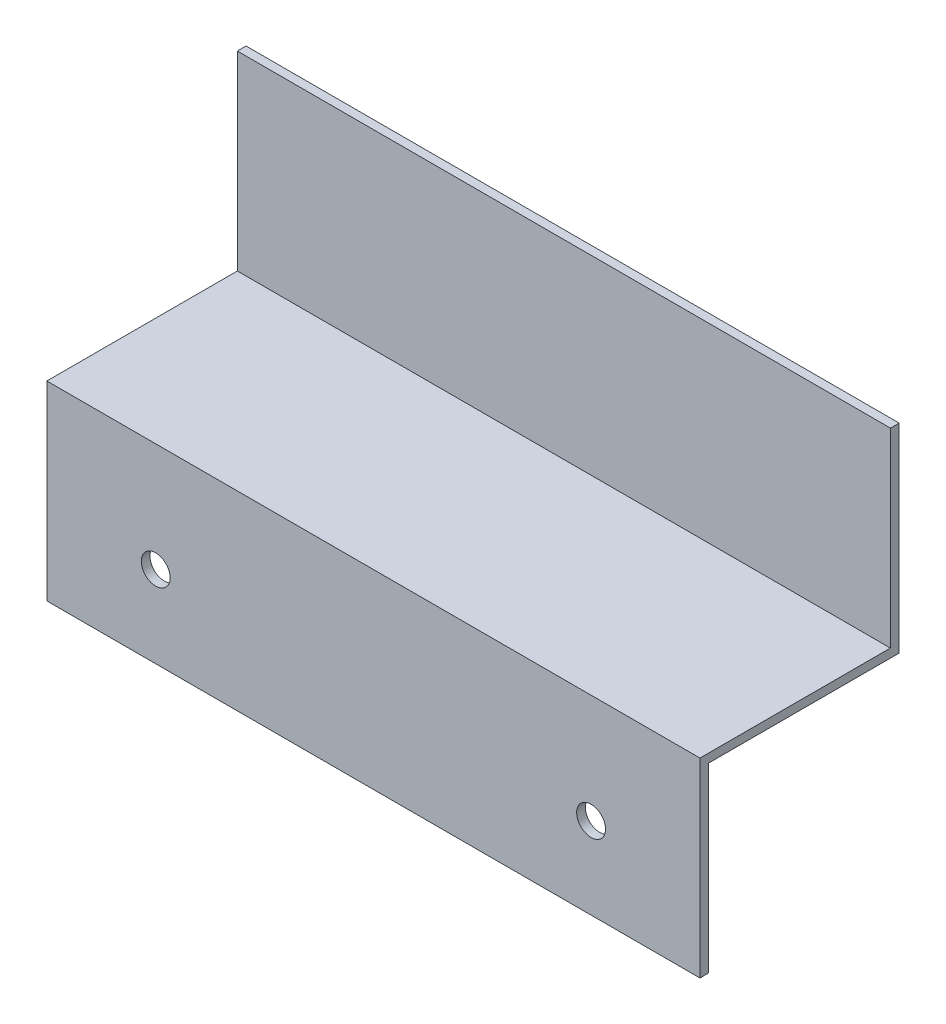
ISO-10303-21;
HEADER;
FILE_DESCRIPTION(('STEP AP214'),'2;1');
FILE_NAME('part.step','',(''),(''),'','','');
FILE_SCHEMA(('AUTOMOTIVE_DESIGN { 1 0 10303 214 1 1 1 1 }'));
ENDSEC;
DATA;
#1=APPLICATION_CONTEXT('core data for automotive mechanical design processes');
#2=APPLICATION_PROTOCOL_DEFINITION('international standard','automotive_design',2000,#1);
#3=PRODUCT_CONTEXT('',#1,'mechanical');
#4=PRODUCT('Part','Part','',(#3));
#5=PRODUCT_RELATED_PRODUCT_CATEGORY('part','',(#4));
#6=PRODUCT_DEFINITION_FORMATION('','',#4);
#7=PRODUCT_DEFINITION_CONTEXT('part definition',#1,'design');
#8=PRODUCT_DEFINITION('design','',#6,#7);
#9=PRODUCT_DEFINITION_SHAPE('','',#8);
#10=(LENGTH_UNIT() NAMED_UNIT(*) SI_UNIT(.MILLI.,.METRE.));
#11=(NAMED_UNIT(*) PLANE_ANGLE_UNIT() SI_UNIT($,.RADIAN.));
#12=(NAMED_UNIT(*) SI_UNIT($,.STERADIAN.) SOLID_ANGLE_UNIT());
#13=UNCERTAINTY_MEASURE_WITH_UNIT(LENGTH_MEASURE(1.E-05),#10,'distance_accuracy_value','');
#14=(GEOMETRIC_REPRESENTATION_CONTEXT(3) GLOBAL_UNCERTAINTY_ASSIGNED_CONTEXT((#13)) GLOBAL_UNIT_ASSIGNED_CONTEXT((#10,
#11,#12)) REPRESENTATION_CONTEXT('',''));
#15=CARTESIAN_POINT('',(0.,0.,0.));
#16=DIRECTION('',(0.,0.,1.));
#17=DIRECTION('',(1.,0.,0.));
#18=AXIS2_PLACEMENT_3D('',#15,#16,#17);
#19=CARTESIAN_POINT('',(152.4,0.,0.));
#20=DIRECTION('',(0.,-1.,0.));
#21=DIRECTION('',(0.,0.,-1.));
#22=AXIS2_PLACEMENT_3D('',#19,#20,#21);
#23=PLANE('',#22);
#24=DIRECTION('',(0.,0.,1.));
#25=VECTOR('',#24,1.);
#26=CARTESIAN_POINT('',(0.,0.,0.));
#27=LINE('',#26,#25);
#28=CARTESIAN_POINT('',(0.,0.,-2.032));
#29=VERTEX_POINT('',#28);
#30=CARTESIAN_POINT('',(0.,0.,0.));
#31=VERTEX_POINT('',#30);
#32=EDGE_CURVE('E131',#29,#31,#27,.T.);
#33=ORIENTED_EDGE('',*,*,#32,.T.);
#34=DIRECTION('',(-1.,0.,0.));
#35=VECTOR('',#34,1.);
#36=CARTESIAN_POINT('',(152.4,0.,0.));
#37=LINE('',#36,#35);
#38=CARTESIAN_POINT('',(152.4,0.,0.));
#39=VERTEX_POINT('',#38);
#40=EDGE_CURVE('E11',#39,#31,#37,.T.);
#41=ORIENTED_EDGE('',*,*,#40,.F.);
#42=DIRECTION('',(0.,0.,1.));
#43=VECTOR('',#42,1.);
#44=CARTESIAN_POINT('',(152.4,0.,0.));
#45=LINE('',#44,#43);
#46=CARTESIAN_POINT('',(152.4,0.,-2.032));
#47=VERTEX_POINT('',#46);
#48=EDGE_CURVE('E145',#47,#39,#45,.T.);
#49=ORIENTED_EDGE('',*,*,#48,.F.);
#50=DIRECTION('',(-1.,0.,0.));
#51=VECTOR('',#50,1.);
#52=CARTESIAN_POINT('',(152.4,0.,-2.032));
#53=LINE('',#52,#51);
#54=EDGE_CURVE('E127',#47,#29,#53,.T.);
#55=ORIENTED_EDGE('',*,*,#54,.T.);
#56=EDGE_LOOP('',(#33,#41,#49,#55));
#57=FACE_BOUND('',#56,.T.);
#58=ADVANCED_FACE('F33',(#57),#23,.F.);
#59=CARTESIAN_POINT('',(152.4,0.,0.));
#60=DIRECTION('',(0.,0.,-1.));
#61=DIRECTION('',(0.,1.,0.));
#62=AXIS2_PLACEMENT_3D('',#59,#60,#61);
#63=PLANE('',#62);
#64=DIRECTION('',(0.,-1.,0.));
#65=VECTOR('',#64,1.);
#66=CARTESIAN_POINT('',(0.,0.,0.));
#67=LINE('',#66,#65);
#68=CARTESIAN_POINT('',(0.,-44.45,0.));
#69=VERTEX_POINT('',#68);
#70=EDGE_CURVE('E134',#31,#69,#67,.T.);
#71=ORIENTED_EDGE('',*,*,#70,.T.);
#72=DIRECTION('',(-1.,0.,0.));
#73=VECTOR('',#72,1.);
#74=CARTESIAN_POINT('',(152.4,-44.45,0.));
#75=LINE('',#74,#73);
#76=CARTESIAN_POINT('',(152.4,-44.45,0.));
#77=VERTEX_POINT('',#76);
#78=EDGE_CURVE('E42',#77,#69,#75,.T.);
#79=ORIENTED_EDGE('',*,*,#78,.F.);
#80=DIRECTION('',(0.,-1.,0.));
#81=VECTOR('',#80,1.);
#82=CARTESIAN_POINT('',(152.4,0.,0.));
#83=LINE('',#82,#81);
#84=EDGE_CURVE('E94',#39,#77,#83,.T.);
#85=ORIENTED_EDGE('',*,*,#84,.F.);
#86=ORIENTED_EDGE('',*,*,#40,.T.);
#87=EDGE_LOOP('',(#71,#79,#85,#86));
#88=FACE_BOUND('',#87,.T.);
#89=ADVANCED_FACE('F203',(#88),#63,.F.);
#90=CARTESIAN_POINT('',(152.4,-44.45,0.));
#91=DIRECTION('',(0.,-1.,0.));
#92=DIRECTION('',(0.,0.,-1.));
#93=AXIS2_PLACEMENT_3D('',#90,#91,#92);
#94=PLANE('',#93);
#95=DIRECTION('',(0.,0.,1.));
#96=VECTOR('',#95,1.);
#97=CARTESIAN_POINT('',(0.,-44.45,0.));
#98=LINE('',#97,#96);
#99=CARTESIAN_POINT('',(0.,-44.45,44.45));
#100=VERTEX_POINT('',#99);
#101=EDGE_CURVE('E136',#69,#100,#98,.T.);
#102=ORIENTED_EDGE('',*,*,#101,.T.);
#103=DIRECTION('',(-1.,0.,0.));
#104=VECTOR('',#103,1.);
#105=CARTESIAN_POINT('',(152.4,-44.45,44.45));
#106=LINE('',#105,#104);
#107=CARTESIAN_POINT('',(152.4,-44.45,44.45));
#108=VERTEX_POINT('',#107);
#109=EDGE_CURVE('E152',#108,#100,#106,.T.);
#110=ORIENTED_EDGE('',*,*,#109,.F.);
#111=DIRECTION('',(0.,0.,1.));
#112=VECTOR('',#111,1.);
#113=CARTESIAN_POINT('',(152.4,-44.45,0.));
#114=LINE('',#113,#112);
#115=EDGE_CURVE('E172',#77,#108,#114,.T.);
#116=ORIENTED_EDGE('',*,*,#115,.F.);
#117=ORIENTED_EDGE('',*,*,#78,.T.);
#118=EDGE_LOOP('',(#102,#110,#116,#117));
#119=FACE_BOUND('',#118,.T.);
#120=ADVANCED_FACE('F207',(#119),#94,.F.);
#121=CARTESIAN_POINT('',(152.4,-44.45,44.45));
#122=DIRECTION('',(0.,0.,-1.));
#123=DIRECTION('',(0.,1.,0.));
#124=AXIS2_PLACEMENT_3D('',#121,#122,#123);
#125=PLANE('',#124);
#126=CARTESIAN_POINT('',(25.4,-69.85,44.45));
#127=DIRECTION('',(0.,0.,1.));
#128=DIRECTION('',(1.,0.,0.));
#129=AXIS2_PLACEMENT_3D('',#126,#127,#128);
#130=CIRCLE('',#129,3.3655);
#131=CARTESIAN_POINT('',(28.7655,-69.85,44.45));
#132=VERTEX_POINT('',#131);
#133=EDGE_CURVE('E158',#132,#132,#130,.T.);
#134=ORIENTED_EDGE('',*,*,#133,.F.);
#135=EDGE_LOOP('',(#134));
#136=FACE_BOUND('',#135,.T.);
#137=CARTESIAN_POINT('',(127.,-69.85,44.45));
#138=DIRECTION('',(0.,0.,1.));
#139=DIRECTION('',(1.,0.,0.));
#140=AXIS2_PLACEMENT_3D('',#137,#138,#139);
#141=CIRCLE('',#140,3.36549999999999);
#142=CARTESIAN_POINT('',(130.3655,-69.85,44.45));
#143=VERTEX_POINT('',#142);
#144=EDGE_CURVE('E163',#143,#143,#141,.T.);
#145=ORIENTED_EDGE('',*,*,#144,.F.);
#146=EDGE_LOOP('',(#145));
#147=FACE_BOUND('',#146,.T.);
#148=DIRECTION('',(0.,-1.,0.));
#149=VECTOR('',#148,1.);
#150=CARTESIAN_POINT('',(0.,-44.45,44.45));
#151=LINE('',#150,#149);
#152=CARTESIAN_POINT('',(0.,-88.9,44.45));
#153=VERTEX_POINT('',#152);
#154=EDGE_CURVE('E138',#100,#153,#151,.T.);
#155=ORIENTED_EDGE('',*,*,#154,.T.);
#156=DIRECTION('',(-1.,0.,0.));
#157=VECTOR('',#156,1.);
#158=CARTESIAN_POINT('',(152.4,-88.9,44.45));
#159=LINE('',#158,#157);
#160=CARTESIAN_POINT('',(152.4,-88.9,44.45));
#161=VERTEX_POINT('',#160);
#162=EDGE_CURVE('E149',#161,#153,#159,.T.);
#163=ORIENTED_EDGE('',*,*,#162,.F.);
#164=DIRECTION('',(0.,-1.,0.));
#165=VECTOR('',#164,1.);
#166=CARTESIAN_POINT('',(152.4,-44.45,44.45));
#167=LINE('',#166,#165);
#168=EDGE_CURVE('E174',#108,#161,#167,.T.);
#169=ORIENTED_EDGE('',*,*,#168,.F.);
#170=ORIENTED_EDGE('',*,*,#109,.T.);
#171=EDGE_LOOP('',(#155,#163,#169,#170));
#172=FACE_BOUND('',#171,.T.);
#173=ADVANCED_FACE('F180',(#136,#147,#172),#125,.F.);
#174=CARTESIAN_POINT('',(152.4,-88.9,44.45));
#175=DIRECTION('',(0.,1.,0.));
#176=DIRECTION('',(0.,0.,1.));
#177=AXIS2_PLACEMENT_3D('',#174,#175,#176);
#178=PLANE('',#177);
#179=DIRECTION('',(0.,0.,-1.));
#180=VECTOR('',#179,1.);
#181=CARTESIAN_POINT('',(0.,-88.9,44.45));
#182=LINE('',#181,#180);
#183=CARTESIAN_POINT('',(0.,-88.9,42.418));
#184=VERTEX_POINT('',#183);
#185=EDGE_CURVE('E140',#153,#184,#182,.T.);
#186=ORIENTED_EDGE('',*,*,#185,.T.);
#187=DIRECTION('',(-1.,0.,0.));
#188=VECTOR('',#187,1.);
#189=CARTESIAN_POINT('',(152.4,-88.9,42.418));
#190=LINE('',#189,#188);
#191=CARTESIAN_POINT('',(152.4,-88.9,42.418));
#192=VERTEX_POINT('',#191);
#193=EDGE_CURVE('E122',#192,#184,#190,.T.);
#194=ORIENTED_EDGE('',*,*,#193,.F.);
#195=DIRECTION('',(0.,0.,-1.));
#196=VECTOR('',#195,1.);
#197=CARTESIAN_POINT('',(152.4,-88.9,44.45));
#198=LINE('',#197,#196);
#199=EDGE_CURVE('E113',#161,#192,#198,.T.);
#200=ORIENTED_EDGE('',*,*,#199,.F.);
#201=ORIENTED_EDGE('',*,*,#162,.T.);
#202=EDGE_LOOP('',(#186,#194,#200,#201));
#203=FACE_BOUND('',#202,.T.);
#204=ADVANCED_FACE('F184',(#203),#178,.F.);
#205=CARTESIAN_POINT('',(152.4,-46.482,42.418));
#206=DIRECTION('',(0.,0.,1.));
#207=DIRECTION('',(0.,-1.,0.));
#208=AXIS2_PLACEMENT_3D('',#205,#206,#207);
#209=PLANE('',#208);
#210=CARTESIAN_POINT('',(25.4,-69.85,42.418));
#211=DIRECTION('',(0.,0.,1.));
#212=DIRECTION('',(0.,-1.,0.));
#213=AXIS2_PLACEMENT_3D('',#210,#211,#212);
#214=CIRCLE('',#213,3.3655);
#215=CARTESIAN_POINT('',(25.4,-73.2155,42.418));
#216=VERTEX_POINT('',#215);
#217=EDGE_CURVE('E36',#216,#216,#214,.T.);
#218=ORIENTED_EDGE('',*,*,#217,.T.);
#219=EDGE_LOOP('',(#218));
#220=FACE_BOUND('',#219,.T.);
#221=CARTESIAN_POINT('',(127.,-69.85,42.418));
#222=DIRECTION('',(0.,0.,1.));
#223=DIRECTION('',(0.,-1.,0.));
#224=AXIS2_PLACEMENT_3D('',#221,#222,#223);
#225=CIRCLE('',#224,3.36549999999999);
#226=CARTESIAN_POINT('',(127.,-73.2155,42.418));
#227=VERTEX_POINT('',#226);
#228=EDGE_CURVE('E156',#227,#227,#225,.T.);
#229=ORIENTED_EDGE('',*,*,#228,.T.);
#230=EDGE_LOOP('',(#229));
#231=FACE_BOUND('',#230,.T.);
#232=DIRECTION('',(0.,1.,0.));
#233=VECTOR('',#232,1.);
#234=CARTESIAN_POINT('',(0.,-46.482,42.418));
#235=LINE('',#234,#233);
#236=CARTESIAN_POINT('',(0.,-46.482,42.418));
#237=VERTEX_POINT('',#236);
#238=EDGE_CURVE('E121',#184,#237,#235,.T.);
#239=ORIENTED_EDGE('',*,*,#238,.T.);
#240=DIRECTION('',(-1.,0.,0.));
#241=VECTOR('',#240,1.);
#242=CARTESIAN_POINT('',(152.4,-46.482,42.418));
#243=LINE('',#242,#241);
#244=CARTESIAN_POINT('',(152.4,-46.482,42.418));
#245=VERTEX_POINT('',#244);
#246=EDGE_CURVE('E118',#245,#237,#243,.T.);
#247=ORIENTED_EDGE('',*,*,#246,.F.);
#248=DIRECTION('',(0.,1.,0.));
#249=VECTOR('',#248,1.);
#250=CARTESIAN_POINT('',(152.4,-46.482,42.418));
#251=LINE('',#250,#249);
#252=EDGE_CURVE('E107',#192,#245,#251,.T.);
#253=ORIENTED_EDGE('',*,*,#252,.F.);
#254=ORIENTED_EDGE('',*,*,#193,.T.);
#255=EDGE_LOOP('',(#239,#247,#253,#254));
#256=FACE_BOUND('',#255,.T.);
#257=ADVANCED_FACE('F119',(#220,#231,#256),#209,.F.);
#258=CARTESIAN_POINT('',(152.4,-46.482,-2.03200000000001));
#259=DIRECTION('',(0.,1.,0.));
#260=DIRECTION('',(0.,0.,1.));
#261=AXIS2_PLACEMENT_3D('',#258,#259,#260);
#262=PLANE('',#261);
#263=DIRECTION('',(0.,0.,-1.));
#264=VECTOR('',#263,1.);
#265=CARTESIAN_POINT('',(0.,-46.482,-2.03200000000001));
#266=LINE('',#265,#264);
#267=CARTESIAN_POINT('',(0.,-46.482,-2.03200000000001));
#268=VERTEX_POINT('',#267);
#269=EDGE_CURVE('E80',#237,#268,#266,.T.);
#270=ORIENTED_EDGE('',*,*,#269,.T.);
#271=DIRECTION('',(-1.,0.,0.));
#272=VECTOR('',#271,1.);
#273=CARTESIAN_POINT('',(152.4,-46.482,-2.03200000000001));
#274=LINE('',#273,#272);
#275=CARTESIAN_POINT('',(152.4,-46.482,-2.03200000000001));
#276=VERTEX_POINT('',#275);
#277=EDGE_CURVE('E123',#276,#268,#274,.T.);
#278=ORIENTED_EDGE('',*,*,#277,.F.);
#279=DIRECTION('',(0.,0.,-1.));
#280=VECTOR('',#279,1.);
#281=CARTESIAN_POINT('',(152.4,-46.482,-2.03200000000001));
#282=LINE('',#281,#280);
#283=EDGE_CURVE('E111',#245,#276,#282,.T.);
#284=ORIENTED_EDGE('',*,*,#283,.F.);
#285=ORIENTED_EDGE('',*,*,#246,.T.);
#286=EDGE_LOOP('',(#270,#278,#284,#285));
#287=FACE_BOUND('',#286,.T.);
#288=ADVANCED_FACE('F125',(#287),#262,.F.);
#289=CARTESIAN_POINT('',(152.4,0.,-2.032));
#290=DIRECTION('',(0.,0.,1.));
#291=DIRECTION('',(0.,-1.,0.));
#292=AXIS2_PLACEMENT_3D('',#289,#290,#291);
#293=PLANE('',#292);
#294=DIRECTION('',(0.,1.,0.));
#295=VECTOR('',#294,1.);
#296=CARTESIAN_POINT('',(0.,0.,-2.032));
#297=LINE('',#296,#295);
#298=EDGE_CURVE('E86',#268,#29,#297,.T.);
#299=ORIENTED_EDGE('',*,*,#298,.T.);
#300=ORIENTED_EDGE('',*,*,#54,.F.);
#301=DIRECTION('',(0.,1.,0.));
#302=VECTOR('',#301,1.);
#303=CARTESIAN_POINT('',(152.4,0.,-2.032));
#304=LINE('',#303,#302);
#305=EDGE_CURVE('E51',#276,#47,#304,.T.);
#306=ORIENTED_EDGE('',*,*,#305,.F.);
#307=ORIENTED_EDGE('',*,*,#277,.T.);
#308=EDGE_LOOP('',(#299,#300,#306,#307));
#309=FACE_BOUND('',#308,.T.);
#310=ADVANCED_FACE('F192',(#309),#293,.F.);
#311=CARTESIAN_POINT('',(152.4,0.,0.));
#312=DIRECTION('',(-1.,0.,0.));
#313=DIRECTION('',(0.,0.,1.));
#314=AXIS2_PLACEMENT_3D('',#311,#312,#313);
#315=PLANE('',#314);
#316=ORIENTED_EDGE('',*,*,#48,.T.);
#317=ORIENTED_EDGE('',*,*,#84,.T.);
#318=ORIENTED_EDGE('',*,*,#115,.T.);
#319=ORIENTED_EDGE('',*,*,#168,.T.);
#320=ORIENTED_EDGE('',*,*,#199,.T.);
#321=ORIENTED_EDGE('',*,*,#252,.T.);
#322=ORIENTED_EDGE('',*,*,#283,.T.);
#323=ORIENTED_EDGE('',*,*,#305,.T.);
#324=EDGE_LOOP('',(#316,#317,#318,#319,#320,#321,#322,#323));
#325=FACE_BOUND('',#324,.T.);
#326=ADVANCED_FACE('F109',(#325),#315,.F.);
#327=CARTESIAN_POINT('',(0.,0.,0.));
#328=DIRECTION('',(-1.,0.,0.));
#329=DIRECTION('',(0.,0.,1.));
#330=AXIS2_PLACEMENT_3D('',#327,#328,#329);
#331=PLANE('',#330);
#332=ORIENTED_EDGE('',*,*,#32,.F.);
#333=ORIENTED_EDGE('',*,*,#298,.F.);
#334=ORIENTED_EDGE('',*,*,#269,.F.);
#335=ORIENTED_EDGE('',*,*,#238,.F.);
#336=ORIENTED_EDGE('',*,*,#185,.F.);
#337=ORIENTED_EDGE('',*,*,#154,.F.);
#338=ORIENTED_EDGE('',*,*,#101,.F.);
#339=ORIENTED_EDGE('',*,*,#70,.F.);
#340=EDGE_LOOP('',(#332,#333,#334,#335,#336,#337,#338,#339));
#341=FACE_BOUND('',#340,.T.);
#342=ADVANCED_FACE('F187',(#341),#331,.T.);
#343=CARTESIAN_POINT('',(127.,-69.85,-2.03200000000001));
#344=DIRECTION('',(0.,0.,1.));
#345=DIRECTION('',(1.,0.,0.));
#346=AXIS2_PLACEMENT_3D('',#343,#344,#345);
#347=CYLINDRICAL_SURFACE('',#346,3.36549999999999);
#348=ORIENTED_EDGE('',*,*,#144,.T.);
#349=EDGE_LOOP('',(#348));
#350=FACE_BOUND('',#349,.T.);
#351=ORIENTED_EDGE('',*,*,#228,.F.);
#352=EDGE_LOOP('',(#351));
#353=FACE_BOUND('',#352,.T.);
#354=ADVANCED_FACE('F227',(#350,#353),#347,.F.);
#355=CARTESIAN_POINT('',(25.4,-69.85,-2.03200000000001));
#356=DIRECTION('',(0.,0.,1.));
#357=DIRECTION('',(1.,0.,0.));
#358=AXIS2_PLACEMENT_3D('',#355,#356,#357);
#359=CYLINDRICAL_SURFACE('',#358,3.3655);
#360=ORIENTED_EDGE('',*,*,#133,.T.);
#361=EDGE_LOOP('',(#360));
#362=FACE_BOUND('',#361,.T.);
#363=ORIENTED_EDGE('',*,*,#217,.F.);
#364=EDGE_LOOP('',(#363));
#365=FACE_BOUND('',#364,.T.);
#366=ADVANCED_FACE('F225',(#362,#365),#359,.F.);
#367=CLOSED_SHELL('',(#58,#89,#120,#173,#204,#257,#288,#310,#326,#342,#354,#366));
#368=MANIFOLD_SOLID_BREP('B2',#367);
#369=ADVANCED_BREP_SHAPE_REPRESENTATION('',(#18,#368),#14);
#370=SHAPE_DEFINITION_REPRESENTATION(#9,#369);
ENDSEC;
END-ISO-10303-21;
